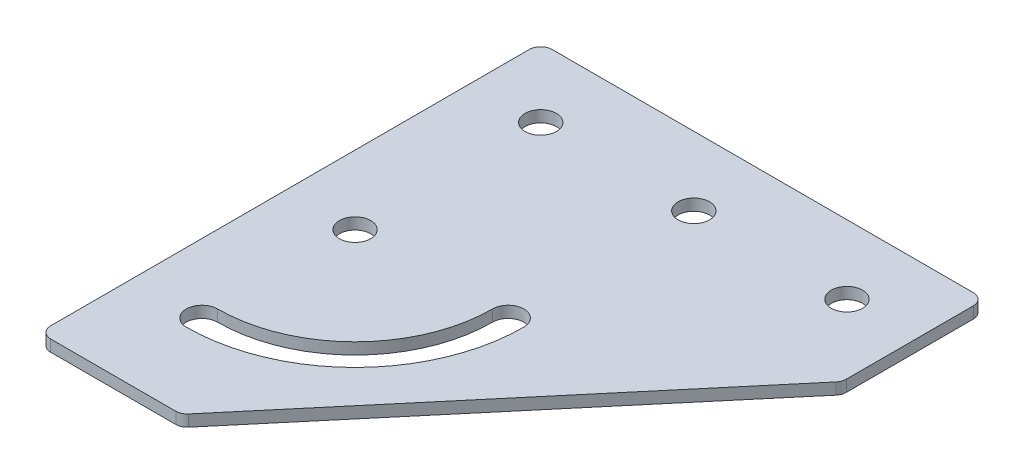
ISO-10303-21;
HEADER;
FILE_DESCRIPTION(('STEP AP214'),'2;1');
FILE_NAME('part.step','',(''),(''),'','','');
FILE_SCHEMA(('AUTOMOTIVE_DESIGN { 1 0 10303 214 1 1 1 1 }'));
ENDSEC;
DATA;
#1=APPLICATION_CONTEXT('core data for automotive mechanical design processes');
#2=APPLICATION_PROTOCOL_DEFINITION('international standard','automotive_design',2000,#1);
#3=PRODUCT_CONTEXT('',#1,'mechanical');
#4=PRODUCT('Part','Part','',(#3));
#5=PRODUCT_RELATED_PRODUCT_CATEGORY('part','',(#4));
#6=PRODUCT_DEFINITION_FORMATION('','',#4);
#7=PRODUCT_DEFINITION_CONTEXT('part definition',#1,'design');
#8=PRODUCT_DEFINITION('design','',#6,#7);
#9=PRODUCT_DEFINITION_SHAPE('','',#8);
#10=(LENGTH_UNIT() NAMED_UNIT(*) SI_UNIT(.MILLI.,.METRE.));
#11=(NAMED_UNIT(*) PLANE_ANGLE_UNIT() SI_UNIT($,.RADIAN.));
#12=(NAMED_UNIT(*) SI_UNIT($,.STERADIAN.) SOLID_ANGLE_UNIT());
#13=UNCERTAINTY_MEASURE_WITH_UNIT(LENGTH_MEASURE(1.E-05),#10,'distance_accuracy_value','');
#14=(GEOMETRIC_REPRESENTATION_CONTEXT(3) GLOBAL_UNCERTAINTY_ASSIGNED_CONTEXT((#13)) GLOBAL_UNIT_ASSIGNED_CONTEXT((#10,
#11,#12)) REPRESENTATION_CONTEXT('',''));
#15=CARTESIAN_POINT('',(0.,0.,0.));
#16=DIRECTION('',(0.,0.,1.));
#17=DIRECTION('',(1.,0.,0.));
#18=AXIS2_PLACEMENT_3D('',#15,#16,#17);
#19=CARTESIAN_POINT('',(0.,0.,0.));
#20=DIRECTION('',(0.,-1.,0.));
#21=DIRECTION('',(0.,0.,-1.));
#22=AXIS2_PLACEMENT_3D('',#19,#20,#21);
#23=PLANE('',#22);
#24=CARTESIAN_POINT('',(0.,0.,88.5));
#25=DIRECTION('',(0.,1.,0.));
#26=DIRECTION('',(0.,0.,1.));
#27=AXIS2_PLACEMENT_3D('',#24,#25,#26);
#28=CIRCLE('',#27,4.10000000000001);
#29=CARTESIAN_POINT('',(0.,0.,84.4));
#30=VERTEX_POINT('',#29);
#31=CARTESIAN_POINT('',(0.,0.,92.6));
#32=VERTEX_POINT('',#31);
#33=EDGE_CURVE('E118',#30,#32,#28,.T.);
#34=ORIENTED_EDGE('',*,*,#33,.T.);
#35=CARTESIAN_POINT('',(0.,0.,48.5));
#36=DIRECTION('',(0.,1.,0.));
#37=DIRECTION('',(0.,0.,1.));
#38=AXIS2_PLACEMENT_3D('',#35,#36,#37);
#39=CIRCLE('',#38,44.1);
#40=CARTESIAN_POINT('',(44.1,0.,48.5));
#41=VERTEX_POINT('',#40);
#42=EDGE_CURVE('E127',#32,#41,#39,.T.);
#43=ORIENTED_EDGE('',*,*,#42,.T.);
#44=CARTESIAN_POINT('',(40.,0.,48.5));
#45=DIRECTION('',(0.,1.,0.));
#46=DIRECTION('',(0.,0.,1.));
#47=AXIS2_PLACEMENT_3D('',#44,#45,#46);
#48=CIRCLE('',#47,4.1);
#49=CARTESIAN_POINT('',(35.9,0.,48.5));
#50=VERTEX_POINT('',#49);
#51=EDGE_CURVE('E31',#41,#50,#48,.T.);
#52=ORIENTED_EDGE('',*,*,#51,.T.);
#53=CARTESIAN_POINT('',(0.,0.,48.5));
#54=DIRECTION('',(0.,-1.,0.));
#55=DIRECTION('',(0.,0.,1.));
#56=AXIS2_PLACEMENT_3D('',#53,#54,#55);
#57=CIRCLE('',#56,35.9);
#58=EDGE_CURVE('E124',#50,#30,#57,.T.);
#59=ORIENTED_EDGE('',*,*,#58,.T.);
#60=EDGE_LOOP('',(#34,#43,#52,#59));
#61=FACE_BOUND('',#60,.T.);
#62=CARTESIAN_POINT('',(80.,0.,0.));
#63=DIRECTION('',(0.,1.,0.));
#64=DIRECTION('',(0.,0.,1.));
#65=AXIS2_PLACEMENT_3D('',#62,#63,#64);
#66=CIRCLE('',#65,4.1);
#67=CARTESIAN_POINT('',(80.,0.,4.1));
#68=VERTEX_POINT('',#67);
#69=EDGE_CURVE('E152',#68,#68,#66,.T.);
#70=ORIENTED_EDGE('',*,*,#69,.T.);
#71=EDGE_LOOP('',(#70));
#72=FACE_BOUND('',#71,.T.);
#73=CARTESIAN_POINT('',(0.,0.,48.5));
#74=DIRECTION('',(0.,1.,0.));
#75=DIRECTION('',(0.,0.,1.));
#76=AXIS2_PLACEMENT_3D('',#73,#74,#75);
#77=CIRCLE('',#76,4.1);
#78=CARTESIAN_POINT('',(0.,0.,52.6));
#79=VERTEX_POINT('',#78);
#80=EDGE_CURVE('E158',#79,#79,#77,.T.);
#81=ORIENTED_EDGE('',*,*,#80,.T.);
#82=EDGE_LOOP('',(#81));
#83=FACE_BOUND('',#82,.T.);
#84=CARTESIAN_POINT('',(40.,0.,0.));
#85=DIRECTION('',(0.,1.,0.));
#86=DIRECTION('',(0.,0.,1.));
#87=AXIS2_PLACEMENT_3D('',#84,#85,#86);
#88=CIRCLE('',#87,4.1);
#89=CARTESIAN_POINT('',(40.,0.,4.10000000000001));
#90=VERTEX_POINT('',#89);
#91=EDGE_CURVE('E164',#90,#90,#88,.T.);
#92=ORIENTED_EDGE('',*,*,#91,.T.);
#93=EDGE_LOOP('',(#92));
#94=FACE_BOUND('',#93,.T.);
#95=CARTESIAN_POINT('',(0.,0.,0.));
#96=DIRECTION('',(0.,1.,0.));
#97=DIRECTION('',(0.,0.,1.));
#98=AXIS2_PLACEMENT_3D('',#95,#96,#97);
#99=CIRCLE('',#98,4.1);
#100=CARTESIAN_POINT('',(0.,0.,4.1));
#101=VERTEX_POINT('',#100);
#102=EDGE_CURVE('E170',#101,#101,#99,.T.);
#103=ORIENTED_EDGE('',*,*,#102,.T.);
#104=EDGE_LOOP('',(#103));
#105=FACE_BOUND('',#104,.T.);
#106=DIRECTION('',(1.,0.,0.));
#107=VECTOR('',#106,1.);
#108=CARTESIAN_POINT('',(-18.,0.,113.));
#109=LINE('',#108,#107);
#110=CARTESIAN_POINT('',(-15.,0.,113.));
#111=VERTEX_POINT('',#110);
#112=CARTESIAN_POINT('',(17.6738198166451,0.,113.));
#113=VERTEX_POINT('',#112);
#114=EDGE_CURVE('E183',#111,#113,#109,.T.);
#115=ORIENTED_EDGE('',*,*,#114,.F.);
#116=CARTESIAN_POINT('',(-15.,0.,110.));
#117=DIRECTION('',(0.,-1.,0.));
#118=DIRECTION('',(0.,0.,-1.));
#119=AXIS2_PLACEMENT_3D('',#116,#117,#118);
#120=CIRCLE('',#119,3.);
#121=CARTESIAN_POINT('',(-18.,0.,110.));
#122=VERTEX_POINT('',#121);
#123=EDGE_CURVE('E233',#111,#122,#120,.T.);
#124=ORIENTED_EDGE('',*,*,#123,.T.);
#125=DIRECTION('',(0.,0.,1.));
#126=VECTOR('',#125,1.);
#127=CARTESIAN_POINT('',(-18.,0.,-18.));
#128=LINE('',#127,#126);
#129=CARTESIAN_POINT('',(-18.,0.,-15.));
#130=VERTEX_POINT('',#129);
#131=EDGE_CURVE('E179',#130,#122,#128,.T.);
#132=ORIENTED_EDGE('',*,*,#131,.F.);
#133=CARTESIAN_POINT('',(-15.,0.,-15.));
#134=DIRECTION('',(0.,-1.,0.));
#135=DIRECTION('',(0.,0.,-1.));
#136=AXIS2_PLACEMENT_3D('',#133,#134,#135);
#137=CIRCLE('',#136,3.);
#138=CARTESIAN_POINT('',(-15.,0.,-18.));
#139=VERTEX_POINT('',#138);
#140=EDGE_CURVE('E225',#130,#139,#137,.T.);
#141=ORIENTED_EDGE('',*,*,#140,.T.);
#142=DIRECTION('',(-1.,0.,0.));
#143=VECTOR('',#142,1.);
#144=CARTESIAN_POINT('',(98.,0.,-18.));
#145=LINE('',#144,#143);
#146=CARTESIAN_POINT('',(95.,0.,-18.));
#147=VERTEX_POINT('',#146);
#148=EDGE_CURVE('E176',#147,#139,#145,.T.);
#149=ORIENTED_EDGE('',*,*,#148,.F.);
#150=CARTESIAN_POINT('',(95.,0.,-15.));
#151=DIRECTION('',(0.,-1.,0.));
#152=DIRECTION('',(0.,0.,-1.));
#153=AXIS2_PLACEMENT_3D('',#150,#151,#152);
#154=CIRCLE('',#153,3.);
#155=CARTESIAN_POINT('',(98.,0.,-15.));
#156=VERTEX_POINT('',#155);
#157=EDGE_CURVE('E227',#147,#156,#154,.T.);
#158=ORIENTED_EDGE('',*,*,#157,.T.);
#159=DIRECTION('',(0.,0.,-1.));
#160=VECTOR('',#159,1.);
#161=CARTESIAN_POINT('',(98.,0.,19.2700644129064));
#162=LINE('',#161,#160);
#163=CARTESIAN_POINT('',(98.,0.,18.1751610322661));
#164=VERTEX_POINT('',#163);
#165=EDGE_CURVE('E189',#164,#156,#162,.T.);
#166=ORIENTED_EDGE('',*,*,#165,.F.);
#167=CARTESIAN_POINT('',(95.,0.,18.1751610322661));
#168=DIRECTION('',(0.,-1.,0.));
#169=DIRECTION('',(0.,0.,-1.));
#170=AXIS2_PLACEMENT_3D('',#167,#168,#169);
#171=CIRCLE('',#170,3.);
#172=CARTESIAN_POINT('',(97.2947335943511,0.,20.1075682696144));
#173=VERTEX_POINT('',#172);
#174=EDGE_CURVE('E229',#164,#173,#171,.T.);
#175=ORIENTED_EDGE('',*,*,#174,.T.);
#176=DIRECTION('',(0.64413574578278,0.,-0.764911198117051));
#177=VECTOR('',#176,1.);
#178=CARTESIAN_POINT('',(19.069527926658,0.,113.));
#179=LINE('',#178,#177);
#180=CARTESIAN_POINT('',(19.9685534109963,0.,111.932407237348));
#181=VERTEX_POINT('',#180);
#182=EDGE_CURVE('E186',#181,#173,#179,.T.);
#183=ORIENTED_EDGE('',*,*,#182,.F.);
#184=CARTESIAN_POINT('',(17.6738198166451,0.,110.));
#185=DIRECTION('',(0.,-1.,0.));
#186=DIRECTION('',(0.,0.,-1.));
#187=AXIS2_PLACEMENT_3D('',#184,#185,#186);
#188=CIRCLE('',#187,3.);
#189=EDGE_CURVE('E231',#181,#113,#188,.T.);
#190=ORIENTED_EDGE('',*,*,#189,.T.);
#191=EDGE_LOOP('',(#115,#124,#132,#141,#149,#158,#166,#175,#183,#190));
#192=FACE_BOUND('',#191,.T.);
#193=ADVANCED_FACE('F16',(#61,#72,#83,#94,#105,#192),#23,.T.);
#194=CARTESIAN_POINT('',(98.,0.,-18.));
#195=DIRECTION('',(0.,0.,-1.));
#196=DIRECTION('',(-1.,0.,0.));
#197=AXIS2_PLACEMENT_3D('',#194,#195,#196);
#198=PLANE('',#197);
#199=DIRECTION('',(-1.,0.,0.));
#200=VECTOR('',#199,1.);
#201=CARTESIAN_POINT('',(98.,3.,-18.));
#202=LINE('',#201,#200);
#203=CARTESIAN_POINT('',(95.,3.,-18.));
#204=VERTEX_POINT('',#203);
#205=CARTESIAN_POINT('',(-15.,3.,-18.));
#206=VERTEX_POINT('',#205);
#207=EDGE_CURVE('E173',#204,#206,#202,.T.);
#208=ORIENTED_EDGE('',*,*,#207,.F.);
#209=DIRECTION('',(0.,1.,0.));
#210=VECTOR('',#209,1.);
#211=CARTESIAN_POINT('',(95.,0.,-18.));
#212=LINE('',#211,#210);
#213=EDGE_CURVE('E10',#204,#147,#212,.F.);
#214=ORIENTED_EDGE('',*,*,#213,.T.);
#215=ORIENTED_EDGE('',*,*,#148,.T.);
#216=DIRECTION('',(0.,1.,0.));
#217=VECTOR('',#216,1.);
#218=CARTESIAN_POINT('',(-15.,0.,-18.));
#219=LINE('',#218,#217);
#220=EDGE_CURVE('E24',#139,#206,#219,.T.);
#221=ORIENTED_EDGE('',*,*,#220,.T.);
#222=EDGE_LOOP('',(#208,#214,#215,#221));
#223=FACE_BOUND('',#222,.T.);
#224=ADVANCED_FACE('F248',(#223),#198,.T.);
#225=CARTESIAN_POINT('',(98.,0.,19.2700644129064));
#226=DIRECTION('',(1.,0.,0.));
#227=DIRECTION('',(0.,0.,-1.));
#228=AXIS2_PLACEMENT_3D('',#225,#226,#227);
#229=PLANE('',#228);
#230=DIRECTION('',(0.,0.,-1.));
#231=VECTOR('',#230,1.);
#232=CARTESIAN_POINT('',(98.,3.,19.2700644129064));
#233=LINE('',#232,#231);
#234=CARTESIAN_POINT('',(98.,3.,18.1751610322661));
#235=VERTEX_POINT('',#234);
#236=CARTESIAN_POINT('',(98.,3.,-15.));
#237=VERTEX_POINT('',#236);
#238=EDGE_CURVE('E180',#235,#237,#233,.T.);
#239=ORIENTED_EDGE('',*,*,#238,.F.);
#240=DIRECTION('',(0.,1.,0.));
#241=VECTOR('',#240,1.);
#242=CARTESIAN_POINT('',(98.,0.,18.1751610322661));
#243=LINE('',#242,#241);
#244=EDGE_CURVE('E243',#235,#164,#243,.F.);
#245=ORIENTED_EDGE('',*,*,#244,.T.);
#246=ORIENTED_EDGE('',*,*,#165,.T.);
#247=DIRECTION('',(0.,1.,0.));
#248=VECTOR('',#247,1.);
#249=CARTESIAN_POINT('',(98.,0.,-15.));
#250=LINE('',#249,#248);
#251=EDGE_CURVE('E240',#156,#237,#250,.T.);
#252=ORIENTED_EDGE('',*,*,#251,.T.);
#253=EDGE_LOOP('',(#239,#245,#246,#252));
#254=FACE_BOUND('',#253,.T.);
#255=ADVANCED_FACE('F262',(#254),#229,.T.);
#256=CARTESIAN_POINT('',(19.069527926658,0.,113.));
#257=DIRECTION('',(0.764911198117051,0.,0.64413574578278));
#258=DIRECTION('',(0.64413574578278,0.,-0.764911198117051));
#259=AXIS2_PLACEMENT_3D('',#256,#257,#258);
#260=PLANE('',#259);
#261=DIRECTION('',(0.64413574578278,0.,-0.764911198117051));
#262=VECTOR('',#261,1.);
#263=CARTESIAN_POINT('',(19.069527926658,3.,113.));
#264=LINE('',#263,#262);
#265=CARTESIAN_POINT('',(19.9685534109963,3.,111.932407237348));
#266=VERTEX_POINT('',#265);
#267=CARTESIAN_POINT('',(97.2947335943511,3.,20.1075682696144));
#268=VERTEX_POINT('',#267);
#269=EDGE_CURVE('E201',#266,#268,#264,.T.);
#270=ORIENTED_EDGE('',*,*,#269,.F.);
#271=DIRECTION('',(0.,1.,0.));
#272=VECTOR('',#271,1.);
#273=CARTESIAN_POINT('',(19.9685534109963,0.,111.932407237348));
#274=LINE('',#273,#272);
#275=EDGE_CURVE('E238',#266,#181,#274,.F.);
#276=ORIENTED_EDGE('',*,*,#275,.T.);
#277=ORIENTED_EDGE('',*,*,#182,.T.);
#278=DIRECTION('',(0.,1.,0.));
#279=VECTOR('',#278,1.);
#280=CARTESIAN_POINT('',(97.2947335943511,0.,20.1075682696144));
#281=LINE('',#280,#279);
#282=EDGE_CURVE('E235',#173,#268,#281,.T.);
#283=ORIENTED_EDGE('',*,*,#282,.T.);
#284=EDGE_LOOP('',(#270,#276,#277,#283));
#285=FACE_BOUND('',#284,.T.);
#286=ADVANCED_FACE('F274',(#285),#260,.T.);
#287=CARTESIAN_POINT('',(-18.,0.,113.));
#288=DIRECTION('',(0.,0.,1.));
#289=DIRECTION('',(1.,0.,0.));
#290=AXIS2_PLACEMENT_3D('',#287,#288,#289);
#291=PLANE('',#290);
#292=DIRECTION('',(1.,0.,0.));
#293=VECTOR('',#292,1.);
#294=CARTESIAN_POINT('',(-18.,3.,113.));
#295=LINE('',#294,#293);
#296=CARTESIAN_POINT('',(-15.,3.,113.));
#297=VERTEX_POINT('',#296);
#298=CARTESIAN_POINT('',(17.6738198166451,3.,113.));
#299=VERTEX_POINT('',#298);
#300=EDGE_CURVE('E198',#297,#299,#295,.T.);
#301=ORIENTED_EDGE('',*,*,#300,.F.);
#302=DIRECTION('',(0.,1.,0.));
#303=VECTOR('',#302,1.);
#304=CARTESIAN_POINT('',(-15.,0.,113.));
#305=LINE('',#304,#303);
#306=EDGE_CURVE('E223',#297,#111,#305,.F.);
#307=ORIENTED_EDGE('',*,*,#306,.T.);
#308=ORIENTED_EDGE('',*,*,#114,.T.);
#309=DIRECTION('',(0.,1.,0.));
#310=VECTOR('',#309,1.);
#311=CARTESIAN_POINT('',(17.6738198166451,0.,113.));
#312=LINE('',#311,#310);
#313=EDGE_CURVE('E220',#113,#299,#312,.T.);
#314=ORIENTED_EDGE('',*,*,#313,.T.);
#315=EDGE_LOOP('',(#301,#307,#308,#314));
#316=FACE_BOUND('',#315,.T.);
#317=ADVANCED_FACE('F282',(#316),#291,.T.);
#318=CARTESIAN_POINT('',(-18.,0.,-18.));
#319=DIRECTION('',(-1.,0.,0.));
#320=DIRECTION('',(0.,0.,1.));
#321=AXIS2_PLACEMENT_3D('',#318,#319,#320);
#322=PLANE('',#321);
#323=ORIENTED_EDGE('',*,*,#131,.T.);
#324=DIRECTION('',(0.,1.,0.));
#325=VECTOR('',#324,1.);
#326=CARTESIAN_POINT('',(-18.,0.,110.));
#327=LINE('',#326,#325);
#328=CARTESIAN_POINT('',(-18.,3.,110.));
#329=VERTEX_POINT('',#328);
#330=EDGE_CURVE('E207',#122,#329,#327,.T.);
#331=ORIENTED_EDGE('',*,*,#330,.T.);
#332=DIRECTION('',(0.,0.,1.));
#333=VECTOR('',#332,1.);
#334=CARTESIAN_POINT('',(-18.,3.,-18.));
#335=LINE('',#334,#333);
#336=CARTESIAN_POINT('',(-18.,3.,-15.));
#337=VERTEX_POINT('',#336);
#338=EDGE_CURVE('E195',#337,#329,#335,.T.);
#339=ORIENTED_EDGE('',*,*,#338,.F.);
#340=DIRECTION('',(0.,1.,0.));
#341=VECTOR('',#340,1.);
#342=CARTESIAN_POINT('',(-18.,0.,-15.));
#343=LINE('',#342,#341);
#344=EDGE_CURVE('E192',#337,#130,#343,.F.);
#345=ORIENTED_EDGE('',*,*,#344,.T.);
#346=EDGE_LOOP('',(#323,#331,#339,#345));
#347=FACE_BOUND('',#346,.T.);
#348=ADVANCED_FACE('F290',(#347),#322,.T.);
#349=CARTESIAN_POINT('',(0.,3.,0.));
#350=DIRECTION('',(0.,-1.,0.));
#351=DIRECTION('',(0.,0.,-1.));
#352=AXIS2_PLACEMENT_3D('',#349,#350,#351);
#353=PLANE('',#352);
#354=CARTESIAN_POINT('',(0.,3.,48.5));
#355=DIRECTION('',(0.,1.,0.));
#356=DIRECTION('',(0.,0.,1.));
#357=AXIS2_PLACEMENT_3D('',#354,#355,#356);
#358=CIRCLE('',#357,44.1);
#359=CARTESIAN_POINT('',(0.,3.,92.6));
#360=VERTEX_POINT('',#359);
#361=CARTESIAN_POINT('',(44.1,3.,48.5));
#362=VERTEX_POINT('',#361);
#363=EDGE_CURVE('E142',#360,#362,#358,.T.);
#364=ORIENTED_EDGE('',*,*,#363,.F.);
#365=CARTESIAN_POINT('',(0.,3.,88.5));
#366=DIRECTION('',(0.,1.,0.));
#367=DIRECTION('',(0.,0.,1.));
#368=AXIS2_PLACEMENT_3D('',#365,#366,#367);
#369=CIRCLE('',#368,4.10000000000001);
#370=CARTESIAN_POINT('',(0.,3.,84.4));
#371=VERTEX_POINT('',#370);
#372=EDGE_CURVE('E39',#371,#360,#369,.T.);
#373=ORIENTED_EDGE('',*,*,#372,.F.);
#374=CARTESIAN_POINT('',(0.,3.,48.5));
#375=DIRECTION('',(0.,-1.,0.));
#376=DIRECTION('',(0.,0.,1.));
#377=AXIS2_PLACEMENT_3D('',#374,#375,#376);
#378=CIRCLE('',#377,35.9);
#379=CARTESIAN_POINT('',(35.9,3.,48.5));
#380=VERTEX_POINT('',#379);
#381=EDGE_CURVE('E133',#380,#371,#378,.T.);
#382=ORIENTED_EDGE('',*,*,#381,.F.);
#383=CARTESIAN_POINT('',(40.,3.,48.5));
#384=DIRECTION('',(0.,1.,0.));
#385=DIRECTION('',(0.,0.,1.));
#386=AXIS2_PLACEMENT_3D('',#383,#384,#385);
#387=CIRCLE('',#386,4.1);
#388=EDGE_CURVE('E136',#362,#380,#387,.T.);
#389=ORIENTED_EDGE('',*,*,#388,.F.);
#390=EDGE_LOOP('',(#364,#373,#382,#389));
#391=FACE_BOUND('',#390,.T.);
#392=CARTESIAN_POINT('',(80.,3.,0.));
#393=DIRECTION('',(0.,1.,0.));
#394=DIRECTION('',(0.,0.,1.));
#395=AXIS2_PLACEMENT_3D('',#392,#393,#394);
#396=CIRCLE('',#395,4.1);
#397=CARTESIAN_POINT('',(80.,3.,4.1));
#398=VERTEX_POINT('',#397);
#399=EDGE_CURVE('E148',#398,#398,#396,.T.);
#400=ORIENTED_EDGE('',*,*,#399,.F.);
#401=EDGE_LOOP('',(#400));
#402=FACE_BOUND('',#401,.T.);
#403=CARTESIAN_POINT('',(0.,3.,48.5));
#404=DIRECTION('',(0.,1.,0.));
#405=DIRECTION('',(0.,0.,1.));
#406=AXIS2_PLACEMENT_3D('',#403,#404,#405);
#407=CIRCLE('',#406,4.1);
#408=CARTESIAN_POINT('',(0.,3.,52.6));
#409=VERTEX_POINT('',#408);
#410=EDGE_CURVE('E155',#409,#409,#407,.T.);
#411=ORIENTED_EDGE('',*,*,#410,.F.);
#412=EDGE_LOOP('',(#411));
#413=FACE_BOUND('',#412,.T.);
#414=CARTESIAN_POINT('',(40.,3.,0.));
#415=DIRECTION('',(0.,1.,0.));
#416=DIRECTION('',(0.,0.,1.));
#417=AXIS2_PLACEMENT_3D('',#414,#415,#416);
#418=CIRCLE('',#417,4.1);
#419=CARTESIAN_POINT('',(40.,3.,4.10000000000001));
#420=VERTEX_POINT('',#419);
#421=EDGE_CURVE('E161',#420,#420,#418,.T.);
#422=ORIENTED_EDGE('',*,*,#421,.F.);
#423=EDGE_LOOP('',(#422));
#424=FACE_BOUND('',#423,.T.);
#425=CARTESIAN_POINT('',(0.,3.,0.));
#426=DIRECTION('',(0.,1.,0.));
#427=DIRECTION('',(0.,0.,1.));
#428=AXIS2_PLACEMENT_3D('',#425,#426,#427);
#429=CIRCLE('',#428,4.1);
#430=CARTESIAN_POINT('',(0.,3.,4.1));
#431=VERTEX_POINT('',#430);
#432=EDGE_CURVE('E167',#431,#431,#429,.T.);
#433=ORIENTED_EDGE('',*,*,#432,.F.);
#434=EDGE_LOOP('',(#433));
#435=FACE_BOUND('',#434,.T.);
#436=ORIENTED_EDGE('',*,*,#338,.T.);
#437=CARTESIAN_POINT('',(-15.,3.,110.));
#438=DIRECTION('',(0.,-1.,0.));
#439=DIRECTION('',(0.,0.,-1.));
#440=AXIS2_PLACEMENT_3D('',#437,#438,#439);
#441=CIRCLE('',#440,3.);
#442=EDGE_CURVE('E218',#329,#297,#441,.F.);
#443=ORIENTED_EDGE('',*,*,#442,.T.);
#444=ORIENTED_EDGE('',*,*,#300,.T.);
#445=CARTESIAN_POINT('',(17.6738198166451,3.,110.));
#446=DIRECTION('',(0.,-1.,0.));
#447=DIRECTION('',(0.,0.,-1.));
#448=AXIS2_PLACEMENT_3D('',#445,#446,#447);
#449=CIRCLE('',#448,3.);
#450=EDGE_CURVE('E216',#299,#266,#449,.F.);
#451=ORIENTED_EDGE('',*,*,#450,.T.);
#452=ORIENTED_EDGE('',*,*,#269,.T.);
#453=CARTESIAN_POINT('',(95.,3.,18.1751610322661));
#454=DIRECTION('',(0.,-1.,0.));
#455=DIRECTION('',(0.,0.,-1.));
#456=AXIS2_PLACEMENT_3D('',#453,#454,#455);
#457=CIRCLE('',#456,3.);
#458=EDGE_CURVE('E214',#268,#235,#457,.F.);
#459=ORIENTED_EDGE('',*,*,#458,.T.);
#460=ORIENTED_EDGE('',*,*,#238,.T.);
#461=CARTESIAN_POINT('',(95.,3.,-15.));
#462=DIRECTION('',(0.,-1.,0.));
#463=DIRECTION('',(0.,0.,-1.));
#464=AXIS2_PLACEMENT_3D('',#461,#462,#463);
#465=CIRCLE('',#464,3.);
#466=EDGE_CURVE('E212',#237,#204,#465,.F.);
#467=ORIENTED_EDGE('',*,*,#466,.T.);
#468=ORIENTED_EDGE('',*,*,#207,.T.);
#469=CARTESIAN_POINT('',(-15.,3.,-15.));
#470=DIRECTION('',(0.,-1.,0.));
#471=DIRECTION('',(0.,0.,-1.));
#472=AXIS2_PLACEMENT_3D('',#469,#470,#471);
#473=CIRCLE('',#472,3.);
#474=EDGE_CURVE('E210',#206,#337,#473,.F.);
#475=ORIENTED_EDGE('',*,*,#474,.T.);
#476=EDGE_LOOP('',(#436,#443,#444,#451,#452,#459,#460,#467,#468,#475));
#477=FACE_BOUND('',#476,.T.);
#478=ADVANCED_FACE('F254',(#391,#402,#413,#424,#435,#477),#353,.F.);
#479=CARTESIAN_POINT('',(-15.,0.,110.));
#480=DIRECTION('',(0.,1.,0.));
#481=DIRECTION('',(0.,0.,1.));
#482=AXIS2_PLACEMENT_3D('',#479,#480,#481);
#483=CYLINDRICAL_SURFACE('',#482,3.);
#484=ORIENTED_EDGE('',*,*,#123,.F.);
#485=ORIENTED_EDGE('',*,*,#306,.F.);
#486=ORIENTED_EDGE('',*,*,#442,.F.);
#487=ORIENTED_EDGE('',*,*,#330,.F.);
#488=EDGE_LOOP('',(#484,#485,#486,#487));
#489=FACE_BOUND('',#488,.T.);
#490=ADVANCED_FACE('F288',(#489),#483,.T.);
#491=CARTESIAN_POINT('',(17.6738198166451,0.,110.));
#492=DIRECTION('',(0.,1.,0.));
#493=DIRECTION('',(0.,0.,1.));
#494=AXIS2_PLACEMENT_3D('',#491,#492,#493);
#495=CYLINDRICAL_SURFACE('',#494,3.);
#496=ORIENTED_EDGE('',*,*,#189,.F.);
#497=ORIENTED_EDGE('',*,*,#275,.F.);
#498=ORIENTED_EDGE('',*,*,#450,.F.);
#499=ORIENTED_EDGE('',*,*,#313,.F.);
#500=EDGE_LOOP('',(#496,#497,#498,#499));
#501=FACE_BOUND('',#500,.T.);
#502=ADVANCED_FACE('F280',(#501),#495,.T.);
#503=CARTESIAN_POINT('',(95.,0.,18.1751610322661));
#504=DIRECTION('',(0.,1.,0.));
#505=DIRECTION('',(0.,0.,1.));
#506=AXIS2_PLACEMENT_3D('',#503,#504,#505);
#507=CYLINDRICAL_SURFACE('',#506,3.);
#508=ORIENTED_EDGE('',*,*,#174,.F.);
#509=ORIENTED_EDGE('',*,*,#244,.F.);
#510=ORIENTED_EDGE('',*,*,#458,.F.);
#511=ORIENTED_EDGE('',*,*,#282,.F.);
#512=EDGE_LOOP('',(#508,#509,#510,#511));
#513=FACE_BOUND('',#512,.T.);
#514=ADVANCED_FACE('F271',(#513),#507,.T.);
#515=CARTESIAN_POINT('',(95.,0.,-15.));
#516=DIRECTION('',(0.,1.,0.));
#517=DIRECTION('',(0.,0.,1.));
#518=AXIS2_PLACEMENT_3D('',#515,#516,#517);
#519=CYLINDRICAL_SURFACE('',#518,3.);
#520=ORIENTED_EDGE('',*,*,#157,.F.);
#521=ORIENTED_EDGE('',*,*,#213,.F.);
#522=ORIENTED_EDGE('',*,*,#466,.F.);
#523=ORIENTED_EDGE('',*,*,#251,.F.);
#524=EDGE_LOOP('',(#520,#521,#522,#523));
#525=FACE_BOUND('',#524,.T.);
#526=ADVANCED_FACE('F260',(#525),#519,.T.);
#527=CARTESIAN_POINT('',(-15.,0.,-15.));
#528=DIRECTION('',(0.,1.,0.));
#529=DIRECTION('',(0.,0.,1.));
#530=AXIS2_PLACEMENT_3D('',#527,#528,#529);
#531=CYLINDRICAL_SURFACE('',#530,3.);
#532=ORIENTED_EDGE('',*,*,#140,.F.);
#533=ORIENTED_EDGE('',*,*,#344,.F.);
#534=ORIENTED_EDGE('',*,*,#474,.F.);
#535=ORIENTED_EDGE('',*,*,#220,.F.);
#536=EDGE_LOOP('',(#532,#533,#534,#535));
#537=FACE_BOUND('',#536,.T.);
#538=ADVANCED_FACE('F18',(#537),#531,.T.);
#539=CARTESIAN_POINT('',(0.,0.,0.));
#540=DIRECTION('',(0.,1.,0.));
#541=DIRECTION('',(0.,0.,1.));
#542=AXIS2_PLACEMENT_3D('',#539,#540,#541);
#543=CYLINDRICAL_SURFACE('',#542,4.1);
#544=ORIENTED_EDGE('',*,*,#102,.F.);
#545=EDGE_LOOP('',(#544));
#546=FACE_BOUND('',#545,.T.);
#547=ORIENTED_EDGE('',*,*,#432,.T.);
#548=EDGE_LOOP('',(#547));
#549=FACE_BOUND('',#548,.T.);
#550=ADVANCED_FACE('F293',(#546,#549),#543,.F.);
#551=CARTESIAN_POINT('',(40.,0.,0.));
#552=DIRECTION('',(0.,1.,0.));
#553=DIRECTION('',(0.,0.,1.));
#554=AXIS2_PLACEMENT_3D('',#551,#552,#553);
#555=CYLINDRICAL_SURFACE('',#554,4.1);
#556=ORIENTED_EDGE('',*,*,#91,.F.);
#557=EDGE_LOOP('',(#556));
#558=FACE_BOUND('',#557,.T.);
#559=ORIENTED_EDGE('',*,*,#421,.T.);
#560=EDGE_LOOP('',(#559));
#561=FACE_BOUND('',#560,.T.);
#562=ADVANCED_FACE('F299',(#558,#561),#555,.F.);
#563=CARTESIAN_POINT('',(0.,0.,48.5));
#564=DIRECTION('',(0.,1.,0.));
#565=DIRECTION('',(0.,0.,1.));
#566=AXIS2_PLACEMENT_3D('',#563,#564,#565);
#567=CYLINDRICAL_SURFACE('',#566,4.1);
#568=ORIENTED_EDGE('',*,*,#80,.F.);
#569=EDGE_LOOP('',(#568));
#570=FACE_BOUND('',#569,.T.);
#571=ORIENTED_EDGE('',*,*,#410,.T.);
#572=EDGE_LOOP('',(#571));
#573=FACE_BOUND('',#572,.T.);
#574=ADVANCED_FACE('F350',(#570,#573),#567,.F.);
#575=CARTESIAN_POINT('',(80.,0.,0.));
#576=DIRECTION('',(0.,1.,0.));
#577=DIRECTION('',(0.,0.,1.));
#578=AXIS2_PLACEMENT_3D('',#575,#576,#577);
#579=CYLINDRICAL_SURFACE('',#578,4.1);
#580=ORIENTED_EDGE('',*,*,#69,.F.);
#581=EDGE_LOOP('',(#580));
#582=FACE_BOUND('',#581,.T.);
#583=ORIENTED_EDGE('',*,*,#399,.T.);
#584=EDGE_LOOP('',(#583));
#585=FACE_BOUND('',#584,.T.);
#586=ADVANCED_FACE('F361',(#582,#585),#579,.F.);
#587=CARTESIAN_POINT('',(0.,0.,88.5));
#588=DIRECTION('',(0.,1.,0.));
#589=DIRECTION('',(0.,0.,1.));
#590=AXIS2_PLACEMENT_3D('',#587,#588,#589);
#591=CYLINDRICAL_SURFACE('',#590,4.10000000000001);
#592=ORIENTED_EDGE('',*,*,#372,.T.);
#593=DIRECTION('',(0.,1.,0.));
#594=VECTOR('',#593,1.);
#595=CARTESIAN_POINT('',(0.,0.,92.6));
#596=LINE('',#595,#594);
#597=EDGE_CURVE('E114',#32,#360,#596,.T.);
#598=ORIENTED_EDGE('',*,*,#597,.F.);
#599=ORIENTED_EDGE('',*,*,#33,.F.);
#600=DIRECTION('',(0.,1.,0.));
#601=VECTOR('',#600,1.);
#602=CARTESIAN_POINT('',(0.,0.,84.4));
#603=LINE('',#602,#601);
#604=EDGE_CURVE('E146',#30,#371,#603,.T.);
#605=ORIENTED_EDGE('',*,*,#604,.T.);
#606=EDGE_LOOP('',(#592,#598,#599,#605));
#607=FACE_BOUND('',#606,.T.);
#608=ADVANCED_FACE('F116',(#607),#591,.F.);
#609=CARTESIAN_POINT('',(0.,0.,48.5));
#610=DIRECTION('',(0.,1.,0.));
#611=DIRECTION('',(0.,0.,1.));
#612=AXIS2_PLACEMENT_3D('',#609,#610,#611);
#613=CYLINDRICAL_SURFACE('',#612,35.9);
#614=ORIENTED_EDGE('',*,*,#381,.T.);
#615=ORIENTED_EDGE('',*,*,#604,.F.);
#616=ORIENTED_EDGE('',*,*,#58,.F.);
#617=DIRECTION('',(0.,1.,0.));
#618=VECTOR('',#617,1.);
#619=CARTESIAN_POINT('',(35.9,0.,48.5));
#620=LINE('',#619,#618);
#621=EDGE_CURVE('E149',#50,#380,#620,.T.);
#622=ORIENTED_EDGE('',*,*,#621,.T.);
#623=EDGE_LOOP('',(#614,#615,#616,#622));
#624=FACE_BOUND('',#623,.T.);
#625=ADVANCED_FACE('F380',(#624),#613,.T.);
#626=CARTESIAN_POINT('',(40.,0.,48.5));
#627=DIRECTION('',(0.,1.,0.));
#628=DIRECTION('',(0.,0.,1.));
#629=AXIS2_PLACEMENT_3D('',#626,#627,#628);
#630=CYLINDRICAL_SURFACE('',#629,4.1);
#631=ORIENTED_EDGE('',*,*,#388,.T.);
#632=ORIENTED_EDGE('',*,*,#621,.F.);
#633=ORIENTED_EDGE('',*,*,#51,.F.);
#634=DIRECTION('',(0.,1.,0.));
#635=VECTOR('',#634,1.);
#636=CARTESIAN_POINT('',(44.1,0.,48.5));
#637=LINE('',#636,#635);
#638=EDGE_CURVE('E123',#41,#362,#637,.T.);
#639=ORIENTED_EDGE('',*,*,#638,.T.);
#640=EDGE_LOOP('',(#631,#632,#633,#639));
#641=FACE_BOUND('',#640,.T.);
#642=ADVANCED_FACE('F389',(#641),#630,.F.);
#643=CARTESIAN_POINT('',(0.,0.,48.5));
#644=DIRECTION('',(0.,1.,0.));
#645=DIRECTION('',(0.,0.,1.));
#646=AXIS2_PLACEMENT_3D('',#643,#644,#645);
#647=CYLINDRICAL_SURFACE('',#646,44.1);
#648=ORIENTED_EDGE('',*,*,#363,.T.);
#649=ORIENTED_EDGE('',*,*,#638,.F.);
#650=ORIENTED_EDGE('',*,*,#42,.F.);
#651=ORIENTED_EDGE('',*,*,#597,.T.);
#652=EDGE_LOOP('',(#648,#649,#650,#651));
#653=FACE_BOUND('',#652,.T.);
#654=ADVANCED_FACE('F128',(#653),#647,.F.);
#655=CLOSED_SHELL('',(#193,#224,#255,#286,#317,#348,#478,#490,#502,#514,#526,#538,#550,#562,
#574,#586,#608,#625,#642,#654));
#656=MANIFOLD_SOLID_BREP('B1',#655);
#657=ADVANCED_BREP_SHAPE_REPRESENTATION('',(#18,#656),#14);
#658=SHAPE_DEFINITION_REPRESENTATION(#9,#657);
ENDSEC;
END-ISO-10303-21;
